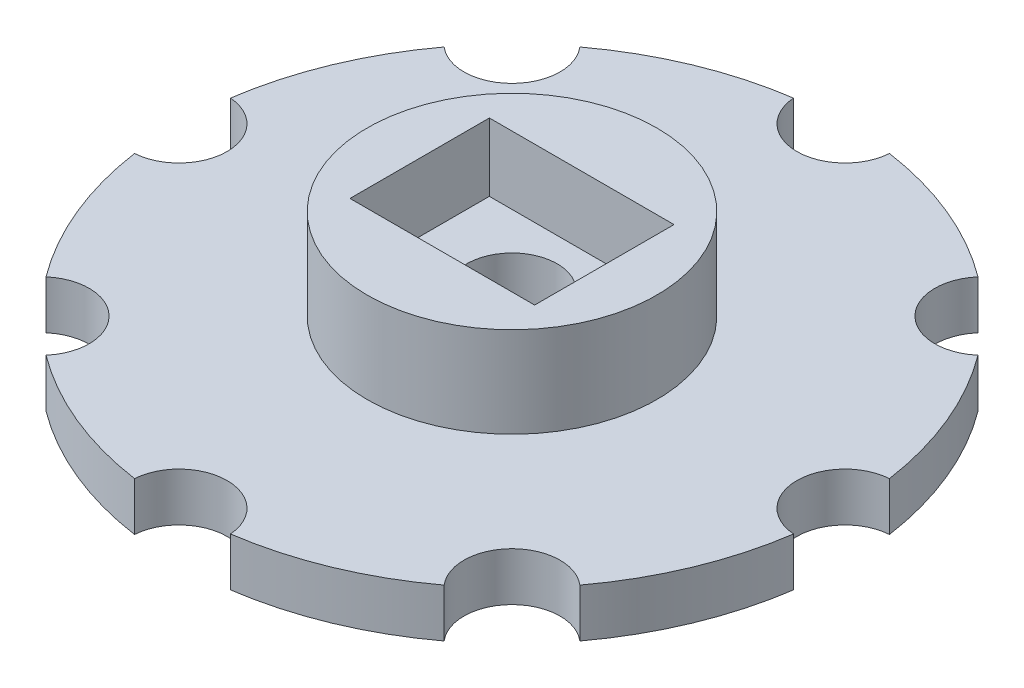
ISO-10303-21;
HEADER;
FILE_DESCRIPTION(('STEP AP214'),'2;1');
FILE_NAME('part.step','',(''),(''),'','','');
FILE_SCHEMA(('AUTOMOTIVE_DESIGN { 1 0 10303 214 1 1 1 1 }'));
ENDSEC;
DATA;
#1=APPLICATION_CONTEXT('core data for automotive mechanical design processes');
#2=APPLICATION_PROTOCOL_DEFINITION('international standard','automotive_design',2000,#1);
#3=PRODUCT_CONTEXT('',#1,'mechanical');
#4=PRODUCT('Part','Part','',(#3));
#5=PRODUCT_RELATED_PRODUCT_CATEGORY('part','',(#4));
#6=PRODUCT_DEFINITION_FORMATION('','',#4);
#7=PRODUCT_DEFINITION_CONTEXT('part definition',#1,'design');
#8=PRODUCT_DEFINITION('design','',#6,#7);
#9=PRODUCT_DEFINITION_SHAPE('','',#8);
#10=(LENGTH_UNIT() NAMED_UNIT(*) SI_UNIT(.MILLI.,.METRE.));
#11=(NAMED_UNIT(*) PLANE_ANGLE_UNIT() SI_UNIT($,.RADIAN.));
#12=(NAMED_UNIT(*) SI_UNIT($,.STERADIAN.) SOLID_ANGLE_UNIT());
#13=UNCERTAINTY_MEASURE_WITH_UNIT(LENGTH_MEASURE(1.E-05),#10,'distance_accuracy_value','');
#14=(GEOMETRIC_REPRESENTATION_CONTEXT(3) GLOBAL_UNCERTAINTY_ASSIGNED_CONTEXT((#13)) GLOBAL_UNIT_ASSIGNED_CONTEXT((#10,
#11,#12)) REPRESENTATION_CONTEXT('',''));
#15=CARTESIAN_POINT('',(0.,0.,0.));
#16=DIRECTION('',(0.,0.,1.));
#17=DIRECTION('',(1.,0.,0.));
#18=AXIS2_PLACEMENT_3D('',#15,#16,#17);
#19=CARTESIAN_POINT('',(0.,9.24152,0.));
#20=DIRECTION('',(0.,-1.,0.));
#21=DIRECTION('',(0.,0.,-1.));
#22=AXIS2_PLACEMENT_3D('',#19,#20,#21);
#23=CYLINDRICAL_SURFACE('',#22,3.175);
#24=CARTESIAN_POINT('',(0.,-0.508,0.));
#25=DIRECTION('',(0.,1.,0.));
#26=DIRECTION('',(0.,0.,1.));
#27=AXIS2_PLACEMENT_3D('',#24,#25,#26);
#28=CIRCLE('',#27,3.175);
#29=CARTESIAN_POINT('',(0.,-0.508,3.175));
#30=VERTEX_POINT('',#29);
#31=EDGE_CURVE('E539',#30,#30,#28,.F.);
#32=ORIENTED_EDGE('',*,*,#31,.T.);
#33=EDGE_LOOP('',(#32));
#34=FACE_BOUND('',#33,.T.);
#35=CARTESIAN_POINT('',(0.,4.47802,0.));
#36=DIRECTION('',(0.,1.,0.));
#37=DIRECTION('',(0.,0.,1.));
#38=AXIS2_PLACEMENT_3D('',#35,#36,#37);
#39=CIRCLE('',#38,3.175);
#40=CARTESIAN_POINT('',(0.,4.47802,3.175));
#41=VERTEX_POINT('',#40);
#42=EDGE_CURVE('E365',#41,#41,#39,.T.);
#43=ORIENTED_EDGE('',*,*,#42,.T.);
#44=EDGE_LOOP('',(#43));
#45=FACE_BOUND('',#44,.T.);
#46=ADVANCED_FACE('F361',(#34,#45),#23,.F.);
#47=CARTESIAN_POINT('',(8.25902930134583,-0.508,-8.25902930134575));
#48=DIRECTION('',(0.,1.,0.));
#49=DIRECTION('',(0.,0.,1.));
#50=AXIS2_PLACEMENT_3D('',#47,#48,#49);
#51=PLANE('',#50);
#52=CARTESIAN_POINT('',(0.,-0.508,0.));
#53=DIRECTION('',(0.,1.,0.));
#54=DIRECTION('',(0.,0.,1.));
#55=AXIS2_PLACEMENT_3D('',#52,#53,#54);
#56=CIRCLE('',#55,23.3600625);
#57=CARTESIAN_POINT('',(23.1164826601257,-0.508,-3.36463213858707));
#58=VERTEX_POINT('',#57);
#59=CARTESIAN_POINT('',(18.7249758475493,-0.508,-13.9666674447629));
#60=VERTEX_POINT('',#59);
#61=EDGE_CURVE('E548',#58,#60,#56,.T.);
#62=ORIENTED_EDGE('',*,*,#61,.F.);
#63=CARTESIAN_POINT('',(23.3600625,-0.508,0.));
#64=DIRECTION('',(0.,-1.,0.));
#65=DIRECTION('',(0.,0.,1.));
#66=AXIS2_PLACEMENT_3D('',#63,#64,#65);
#67=CIRCLE('',#66,3.3734375);
#68=CARTESIAN_POINT('',(23.1164826601257,-0.508,3.36463213858709));
#69=VERTEX_POINT('',#68);
#70=EDGE_CURVE('E593',#69,#58,#67,.T.);
#71=ORIENTED_EDGE('',*,*,#70,.F.);
#72=CARTESIAN_POINT('',(0.,-0.508,0.));
#73=DIRECTION('',(0.,1.,0.));
#74=DIRECTION('',(0.,0.,1.));
#75=AXIS2_PLACEMENT_3D('',#72,#73,#74);
#76=CIRCLE('',#75,23.3600625);
#77=CARTESIAN_POINT('',(18.7249758475493,-0.508,13.9666674447629));
#78=VERTEX_POINT('',#77);
#79=EDGE_CURVE('E590',#78,#69,#76,.T.);
#80=ORIENTED_EDGE('',*,*,#79,.F.);
#81=CARTESIAN_POINT('',(16.5180586026917,-0.508,16.5180586026915));
#82=DIRECTION('',(0.,-1.,0.));
#83=DIRECTION('',(0.,0.,1.));
#84=AXIS2_PLACEMENT_3D('',#81,#82,#83);
#85=CIRCLE('',#84,3.3734375);
#86=CARTESIAN_POINT('',(13.9666674447631,-0.508,18.7249758475492));
#87=VERTEX_POINT('',#86);
#88=EDGE_CURVE('E587',#87,#78,#85,.T.);
#89=ORIENTED_EDGE('',*,*,#88,.F.);
#90=CARTESIAN_POINT('',(0.,-0.508,0.));
#91=DIRECTION('',(0.,1.,0.));
#92=DIRECTION('',(0.,0.,1.));
#93=AXIS2_PLACEMENT_3D('',#90,#91,#92);
#94=CIRCLE('',#93,23.3600625);
#95=CARTESIAN_POINT('',(3.36463213858709,-0.508,23.1164826601257));
#96=VERTEX_POINT('',#95);
#97=EDGE_CURVE('E584',#96,#87,#94,.T.);
#98=ORIENTED_EDGE('',*,*,#97,.F.);
#99=CARTESIAN_POINT('',(0.,-0.508,23.3600625));
#100=DIRECTION('',(0.,-1.,0.));
#101=DIRECTION('',(0.,0.,1.));
#102=AXIS2_PLACEMENT_3D('',#99,#100,#101);
#103=CIRCLE('',#102,3.3734375);
#104=CARTESIAN_POINT('',(-3.36463213858708,-0.508,23.1164826601257));
#105=VERTEX_POINT('',#104);
#106=EDGE_CURVE('E581',#105,#96,#103,.T.);
#107=ORIENTED_EDGE('',*,*,#106,.F.);
#108=CARTESIAN_POINT('',(0.,-0.508,0.));
#109=DIRECTION('',(0.,1.,0.));
#110=DIRECTION('',(0.,0.,1.));
#111=AXIS2_PLACEMENT_3D('',#108,#109,#110);
#112=CIRCLE('',#111,23.3600625);
#113=CARTESIAN_POINT('',(-13.9666674447631,-0.508,18.7249758475492));
#114=VERTEX_POINT('',#113);
#115=EDGE_CURVE('E578',#114,#105,#112,.T.);
#116=ORIENTED_EDGE('',*,*,#115,.F.);
#117=CARTESIAN_POINT('',(-16.5180586026917,-0.508,16.5180586026915));
#118=DIRECTION('',(0.,-1.,0.));
#119=DIRECTION('',(0.,0.,1.));
#120=AXIS2_PLACEMENT_3D('',#117,#118,#119);
#121=CIRCLE('',#120,3.3734375);
#122=CARTESIAN_POINT('',(-18.7249758475493,-0.508,13.9666674447629));
#123=VERTEX_POINT('',#122);
#124=EDGE_CURVE('E575',#123,#114,#121,.T.);
#125=ORIENTED_EDGE('',*,*,#124,.F.);
#126=CARTESIAN_POINT('',(0.,-0.508,0.));
#127=DIRECTION('',(0.,1.,0.));
#128=DIRECTION('',(0.,0.,1.));
#129=AXIS2_PLACEMENT_3D('',#126,#127,#128);
#130=CIRCLE('',#129,23.3600625);
#131=CARTESIAN_POINT('',(-23.1164826601257,-0.508,3.36463213858709));
#132=VERTEX_POINT('',#131);
#133=EDGE_CURVE('E572',#132,#123,#130,.T.);
#134=ORIENTED_EDGE('',*,*,#133,.F.);
#135=CARTESIAN_POINT('',(-23.3600625,-0.508,0.));
#136=DIRECTION('',(0.,-1.,0.));
#137=DIRECTION('',(0.,0.,1.));
#138=AXIS2_PLACEMENT_3D('',#135,#136,#137);
#139=CIRCLE('',#138,3.3734375);
#140=CARTESIAN_POINT('',(-23.1164826601257,-0.508,-3.36463213858707));
#141=VERTEX_POINT('',#140);
#142=EDGE_CURVE('E569',#141,#132,#139,.T.);
#143=ORIENTED_EDGE('',*,*,#142,.F.);
#144=CARTESIAN_POINT('',(0.,-0.508,0.));
#145=DIRECTION('',(0.,1.,0.));
#146=DIRECTION('',(0.,0.,1.));
#147=AXIS2_PLACEMENT_3D('',#144,#145,#146);
#148=CIRCLE('',#147,23.3600625);
#149=CARTESIAN_POINT('',(-18.7249758475493,-0.508,-13.9666674447629));
#150=VERTEX_POINT('',#149);
#151=EDGE_CURVE('E566',#150,#141,#148,.T.);
#152=ORIENTED_EDGE('',*,*,#151,.F.);
#153=CARTESIAN_POINT('',(-16.5180586026917,-0.508,-16.5180586026915));
#154=DIRECTION('',(0.,-1.,0.));
#155=DIRECTION('',(0.,0.,1.));
#156=AXIS2_PLACEMENT_3D('',#153,#154,#155);
#157=CIRCLE('',#156,3.3734375);
#158=CARTESIAN_POINT('',(-13.9666674447631,-0.508,-18.7249758475492));
#159=VERTEX_POINT('',#158);
#160=EDGE_CURVE('E563',#159,#150,#157,.T.);
#161=ORIENTED_EDGE('',*,*,#160,.F.);
#162=CARTESIAN_POINT('',(0.,-0.508,0.));
#163=DIRECTION('',(0.,1.,0.));
#164=DIRECTION('',(0.,0.,1.));
#165=AXIS2_PLACEMENT_3D('',#162,#163,#164);
#166=CIRCLE('',#165,23.3600625);
#167=CARTESIAN_POINT('',(-3.36463213858707,-0.508,-23.1164826601257));
#168=VERTEX_POINT('',#167);
#169=EDGE_CURVE('E560',#168,#159,#166,.T.);
#170=ORIENTED_EDGE('',*,*,#169,.F.);
#171=CARTESIAN_POINT('',(0.,-0.508,-23.3600625));
#172=DIRECTION('',(0.,-1.,0.));
#173=DIRECTION('',(0.,0.,1.));
#174=AXIS2_PLACEMENT_3D('',#171,#172,#173);
#175=CIRCLE('',#174,3.3734375);
#176=CARTESIAN_POINT('',(3.36463213858708,-0.508,-23.1164826601257));
#177=VERTEX_POINT('',#176);
#178=EDGE_CURVE('E557',#177,#168,#175,.T.);
#179=ORIENTED_EDGE('',*,*,#178,.F.);
#180=CARTESIAN_POINT('',(0.,-0.508,0.));
#181=DIRECTION('',(0.,1.,0.));
#182=DIRECTION('',(0.,0.,1.));
#183=AXIS2_PLACEMENT_3D('',#180,#181,#182);
#184=CIRCLE('',#183,23.3600625);
#185=CARTESIAN_POINT('',(13.9666674447631,-0.508,-18.7249758475492));
#186=VERTEX_POINT('',#185);
#187=EDGE_CURVE('E554',#186,#177,#184,.T.);
#188=ORIENTED_EDGE('',*,*,#187,.F.);
#189=CARTESIAN_POINT('',(16.5180586026917,-0.508,-16.5180586026915));
#190=DIRECTION('',(0.,-1.,0.));
#191=DIRECTION('',(0.,0.,1.));
#192=AXIS2_PLACEMENT_3D('',#189,#190,#191);
#193=CIRCLE('',#192,3.3734375);
#194=EDGE_CURVE('E551',#60,#186,#193,.T.);
#195=ORIENTED_EDGE('',*,*,#194,.F.);
#196=EDGE_LOOP('',(#62,#71,#80,#89,#98,#107,#116,#125,#134,#143,#152,#161,#170,#179,#188,#195));
#197=FACE_BOUND('',#196,.T.);
#198=ORIENTED_EDGE('',*,*,#31,.F.);
#199=EDGE_LOOP('',(#198));
#200=FACE_BOUND('',#199,.T.);
#201=ADVANCED_FACE('F666',(#197,#200),#51,.F.);
#202=CARTESIAN_POINT('',(0.,9.24052,0.));
#203=DIRECTION('',(0.,1.,0.));
#204=DIRECTION('',(0.,0.,1.));
#205=AXIS2_PLACEMENT_3D('',#202,#203,#204);
#206=PLANE('',#205);
#207=DIRECTION('',(0.,0.,1.));
#208=VECTOR('',#207,1.);
#209=CARTESIAN_POINT('',(-6.477,9.24052,-4.8895));
#210=LINE('',#209,#208);
#211=CARTESIAN_POINT('',(-6.477,9.24052,-4.8895));
#212=VERTEX_POINT('',#211);
#213=CARTESIAN_POINT('',(-6.477,9.24052,4.8895));
#214=VERTEX_POINT('',#213);
#215=EDGE_CURVE('E377',#212,#214,#210,.T.);
#216=ORIENTED_EDGE('',*,*,#215,.F.);
#217=DIRECTION('',(-1.,0.,0.));
#218=VECTOR('',#217,1.);
#219=CARTESIAN_POINT('',(-6.477,9.24052,-4.8895));
#220=LINE('',#219,#218);
#221=CARTESIAN_POINT('',(6.477,9.24052,-4.8895));
#222=VERTEX_POINT('',#221);
#223=EDGE_CURVE('E521',#222,#212,#220,.T.);
#224=ORIENTED_EDGE('',*,*,#223,.F.);
#225=DIRECTION('',(0.,0.,-1.));
#226=VECTOR('',#225,1.);
#227=CARTESIAN_POINT('',(6.477,9.24052,-4.8895));
#228=LINE('',#227,#226);
#229=CARTESIAN_POINT('',(6.477,9.24052,4.8895));
#230=VERTEX_POINT('',#229);
#231=EDGE_CURVE('E503',#230,#222,#228,.T.);
#232=ORIENTED_EDGE('',*,*,#231,.F.);
#233=DIRECTION('',(1.,0.,0.));
#234=VECTOR('',#233,1.);
#235=CARTESIAN_POINT('',(-6.477,9.24052,4.8895));
#236=LINE('',#235,#234);
#237=EDGE_CURVE('E514',#214,#230,#236,.T.);
#238=ORIENTED_EDGE('',*,*,#237,.F.);
#239=EDGE_LOOP('',(#216,#224,#232,#238));
#240=FACE_BOUND('',#239,.T.);
#241=CARTESIAN_POINT('',(0.,9.24052,0.));
#242=DIRECTION('',(0.,1.,0.));
#243=DIRECTION('',(0.,0.,1.));
#244=AXIS2_PLACEMENT_3D('',#241,#242,#243);
#245=CIRCLE('',#244,10.16);
#246=CARTESIAN_POINT('',(0.,9.24052,10.16));
#247=VERTEX_POINT('',#246);
#248=EDGE_CURVE('E545',#247,#247,#245,.T.);
#249=ORIENTED_EDGE('',*,*,#248,.T.);
#250=EDGE_LOOP('',(#249));
#251=FACE_BOUND('',#250,.T.);
#252=ADVANCED_FACE('F518',(#240,#251),#206,.T.);
#253=CARTESIAN_POINT('',(8.25902930134583,2.89052,-8.25902930134575));
#254=DIRECTION('',(0.,1.,0.));
#255=DIRECTION('',(0.,0.,1.));
#256=AXIS2_PLACEMENT_3D('',#253,#254,#255);
#257=PLANE('',#256);
#258=CARTESIAN_POINT('',(0.,2.89052,0.));
#259=DIRECTION('',(0.,1.,0.));
#260=DIRECTION('',(0.,0.,1.));
#261=AXIS2_PLACEMENT_3D('',#258,#259,#260);
#262=CIRCLE('',#261,23.3600625);
#263=CARTESIAN_POINT('',(23.1164826601257,2.89052,-3.36463213858707));
#264=VERTEX_POINT('',#263);
#265=CARTESIAN_POINT('',(18.7249758475493,2.89052,-13.9666674447629));
#266=VERTEX_POINT('',#265);
#267=EDGE_CURVE('E596',#264,#266,#262,.T.);
#268=ORIENTED_EDGE('',*,*,#267,.T.);
#269=CARTESIAN_POINT('',(16.5180586026917,2.89052,-16.5180586026915));
#270=DIRECTION('',(0.,-1.,0.));
#271=DIRECTION('',(0.,0.,1.));
#272=AXIS2_PLACEMENT_3D('',#269,#270,#271);
#273=CIRCLE('',#272,3.3734375);
#274=CARTESIAN_POINT('',(13.9666674447631,2.89052,-18.7249758475492));
#275=VERTEX_POINT('',#274);
#276=EDGE_CURVE('E598',#266,#275,#273,.T.);
#277=ORIENTED_EDGE('',*,*,#276,.T.);
#278=CARTESIAN_POINT('',(0.,2.89052,0.));
#279=DIRECTION('',(0.,1.,0.));
#280=DIRECTION('',(0.,0.,1.));
#281=AXIS2_PLACEMENT_3D('',#278,#279,#280);
#282=CIRCLE('',#281,23.3600625);
#283=CARTESIAN_POINT('',(3.36463213858708,2.89052,-23.1164826601257));
#284=VERTEX_POINT('',#283);
#285=EDGE_CURVE('E600',#275,#284,#282,.T.);
#286=ORIENTED_EDGE('',*,*,#285,.T.);
#287=CARTESIAN_POINT('',(0.,2.89052,-23.3600625));
#288=DIRECTION('',(0.,-1.,0.));
#289=DIRECTION('',(0.,0.,1.));
#290=AXIS2_PLACEMENT_3D('',#287,#288,#289);
#291=CIRCLE('',#290,3.3734375);
#292=CARTESIAN_POINT('',(-3.36463213858707,2.89052,-23.1164826601257));
#293=VERTEX_POINT('',#292);
#294=EDGE_CURVE('E602',#284,#293,#291,.T.);
#295=ORIENTED_EDGE('',*,*,#294,.T.);
#296=CARTESIAN_POINT('',(0.,2.89052,0.));
#297=DIRECTION('',(0.,1.,0.));
#298=DIRECTION('',(0.,0.,1.));
#299=AXIS2_PLACEMENT_3D('',#296,#297,#298);
#300=CIRCLE('',#299,23.3600625);
#301=CARTESIAN_POINT('',(-13.9666674447631,2.89052,-18.7249758475492));
#302=VERTEX_POINT('',#301);
#303=EDGE_CURVE('E604',#293,#302,#300,.T.);
#304=ORIENTED_EDGE('',*,*,#303,.T.);
#305=CARTESIAN_POINT('',(-16.5180586026917,2.89052,-16.5180586026915));
#306=DIRECTION('',(0.,-1.,0.));
#307=DIRECTION('',(0.,0.,1.));
#308=AXIS2_PLACEMENT_3D('',#305,#306,#307);
#309=CIRCLE('',#308,3.3734375);
#310=CARTESIAN_POINT('',(-18.7249758475493,2.89052,-13.9666674447629));
#311=VERTEX_POINT('',#310);
#312=EDGE_CURVE('E606',#302,#311,#309,.T.);
#313=ORIENTED_EDGE('',*,*,#312,.T.);
#314=CARTESIAN_POINT('',(0.,2.89052,0.));
#315=DIRECTION('',(0.,1.,0.));
#316=DIRECTION('',(0.,0.,1.));
#317=AXIS2_PLACEMENT_3D('',#314,#315,#316);
#318=CIRCLE('',#317,23.3600625);
#319=CARTESIAN_POINT('',(-23.1164826601257,2.89052,-3.36463213858707));
#320=VERTEX_POINT('',#319);
#321=EDGE_CURVE('E608',#311,#320,#318,.T.);
#322=ORIENTED_EDGE('',*,*,#321,.T.);
#323=CARTESIAN_POINT('',(-23.3600625,2.89052,0.));
#324=DIRECTION('',(0.,-1.,0.));
#325=DIRECTION('',(0.,0.,1.));
#326=AXIS2_PLACEMENT_3D('',#323,#324,#325);
#327=CIRCLE('',#326,3.3734375);
#328=CARTESIAN_POINT('',(-23.1164826601257,2.89052,3.36463213858709));
#329=VERTEX_POINT('',#328);
#330=EDGE_CURVE('E610',#320,#329,#327,.T.);
#331=ORIENTED_EDGE('',*,*,#330,.T.);
#332=CARTESIAN_POINT('',(0.,2.89052,0.));
#333=DIRECTION('',(0.,1.,0.));
#334=DIRECTION('',(0.,0.,1.));
#335=AXIS2_PLACEMENT_3D('',#332,#333,#334);
#336=CIRCLE('',#335,23.3600625);
#337=CARTESIAN_POINT('',(-18.7249758475493,2.89052,13.9666674447629));
#338=VERTEX_POINT('',#337);
#339=EDGE_CURVE('E612',#329,#338,#336,.T.);
#340=ORIENTED_EDGE('',*,*,#339,.T.);
#341=CARTESIAN_POINT('',(-16.5180586026917,2.89052,16.5180586026915));
#342=DIRECTION('',(0.,-1.,0.));
#343=DIRECTION('',(0.,0.,1.));
#344=AXIS2_PLACEMENT_3D('',#341,#342,#343);
#345=CIRCLE('',#344,3.3734375);
#346=CARTESIAN_POINT('',(-13.9666674447631,2.89052,18.7249758475492));
#347=VERTEX_POINT('',#346);
#348=EDGE_CURVE('E614',#338,#347,#345,.T.);
#349=ORIENTED_EDGE('',*,*,#348,.T.);
#350=CARTESIAN_POINT('',(0.,2.89052,0.));
#351=DIRECTION('',(0.,1.,0.));
#352=DIRECTION('',(0.,0.,1.));
#353=AXIS2_PLACEMENT_3D('',#350,#351,#352);
#354=CIRCLE('',#353,23.3600625);
#355=CARTESIAN_POINT('',(-3.36463213858708,2.89052,23.1164826601257));
#356=VERTEX_POINT('',#355);
#357=EDGE_CURVE('E616',#347,#356,#354,.T.);
#358=ORIENTED_EDGE('',*,*,#357,.T.);
#359=CARTESIAN_POINT('',(0.,2.89052,23.3600625));
#360=DIRECTION('',(0.,-1.,0.));
#361=DIRECTION('',(0.,0.,1.));
#362=AXIS2_PLACEMENT_3D('',#359,#360,#361);
#363=CIRCLE('',#362,3.3734375);
#364=CARTESIAN_POINT('',(3.36463213858709,2.89052,23.1164826601257));
#365=VERTEX_POINT('',#364);
#366=EDGE_CURVE('E618',#356,#365,#363,.T.);
#367=ORIENTED_EDGE('',*,*,#366,.T.);
#368=CARTESIAN_POINT('',(0.,2.89052,0.));
#369=DIRECTION('',(0.,1.,0.));
#370=DIRECTION('',(0.,0.,1.));
#371=AXIS2_PLACEMENT_3D('',#368,#369,#370);
#372=CIRCLE('',#371,23.3600625);
#373=CARTESIAN_POINT('',(13.9666674447631,2.89052,18.7249758475492));
#374=VERTEX_POINT('',#373);
#375=EDGE_CURVE('E620',#365,#374,#372,.T.);
#376=ORIENTED_EDGE('',*,*,#375,.T.);
#377=CARTESIAN_POINT('',(16.5180586026917,2.89052,16.5180586026915));
#378=DIRECTION('',(0.,-1.,0.));
#379=DIRECTION('',(0.,0.,1.));
#380=AXIS2_PLACEMENT_3D('',#377,#378,#379);
#381=CIRCLE('',#380,3.3734375);
#382=CARTESIAN_POINT('',(18.7249758475493,2.89052,13.9666674447629));
#383=VERTEX_POINT('',#382);
#384=EDGE_CURVE('E622',#374,#383,#381,.T.);
#385=ORIENTED_EDGE('',*,*,#384,.T.);
#386=CARTESIAN_POINT('',(0.,2.89052,0.));
#387=DIRECTION('',(0.,1.,0.));
#388=DIRECTION('',(0.,0.,1.));
#389=AXIS2_PLACEMENT_3D('',#386,#387,#388);
#390=CIRCLE('',#389,23.3600625);
#391=CARTESIAN_POINT('',(23.1164826601257,2.89052,3.36463213858709));
#392=VERTEX_POINT('',#391);
#393=EDGE_CURVE('E624',#383,#392,#390,.T.);
#394=ORIENTED_EDGE('',*,*,#393,.T.);
#395=CARTESIAN_POINT('',(23.3600625,2.89052,0.));
#396=DIRECTION('',(0.,-1.,0.));
#397=DIRECTION('',(0.,0.,1.));
#398=AXIS2_PLACEMENT_3D('',#395,#396,#397);
#399=CIRCLE('',#398,3.3734375);
#400=EDGE_CURVE('E385',#392,#264,#399,.T.);
#401=ORIENTED_EDGE('',*,*,#400,.T.);
#402=EDGE_LOOP('',(#268,#277,#286,#295,#304,#313,#322,#331,#340,#349,#358,#367,#376,#385,#394,#401));
#403=FACE_BOUND('',#402,.T.);
#404=CARTESIAN_POINT('',(0.,2.89052,0.));
#405=DIRECTION('',(0.,1.,0.));
#406=DIRECTION('',(0.,0.,1.));
#407=AXIS2_PLACEMENT_3D('',#404,#405,#406);
#408=CIRCLE('',#407,10.16);
#409=CARTESIAN_POINT('',(0.,2.89052,10.16));
#410=VERTEX_POINT('',#409);
#411=EDGE_CURVE('E542',#410,#410,#408,.T.);
#412=ORIENTED_EDGE('',*,*,#411,.F.);
#413=EDGE_LOOP('',(#412));
#414=FACE_BOUND('',#413,.T.);
#415=ADVANCED_FACE('F734',(#403,#414),#257,.T.);
#416=CARTESIAN_POINT('',(0.,2.89052,0.));
#417=DIRECTION('',(0.,-1.,0.));
#418=DIRECTION('',(0.,0.,-1.));
#419=AXIS2_PLACEMENT_3D('',#416,#417,#418);
#420=CYLINDRICAL_SURFACE('',#419,23.3600625);
#421=DIRECTION('',(0.,-1.,0.));
#422=VECTOR('',#421,1.);
#423=CARTESIAN_POINT('',(23.1164826601257,2.89052,-3.36463213858707));
#424=LINE('',#423,#422);
#425=EDGE_CURVE('E627',#264,#58,#424,.T.);
#426=ORIENTED_EDGE('',*,*,#425,.T.);
#427=ORIENTED_EDGE('',*,*,#61,.T.);
#428=DIRECTION('',(0.,-1.,0.));
#429=VECTOR('',#428,1.);
#430=CARTESIAN_POINT('',(18.7249758475493,2.89052,-13.9666674447629));
#431=LINE('',#430,#429);
#432=EDGE_CURVE('E12',#266,#60,#431,.T.);
#433=ORIENTED_EDGE('',*,*,#432,.F.);
#434=ORIENTED_EDGE('',*,*,#267,.F.);
#435=EDGE_LOOP('',(#426,#427,#433,#434));
#436=FACE_BOUND('',#435,.T.);
#437=ADVANCED_FACE('F363',(#436),#420,.T.);
#438=CARTESIAN_POINT('',(16.5180586026917,2.89052,-16.5180586026915));
#439=DIRECTION('',(0.,-1.,0.));
#440=DIRECTION('',(0.,0.,-1.));
#441=AXIS2_PLACEMENT_3D('',#438,#439,#440);
#442=CYLINDRICAL_SURFACE('',#441,3.3734375);
#443=ORIENTED_EDGE('',*,*,#432,.T.);
#444=ORIENTED_EDGE('',*,*,#194,.T.);
#445=DIRECTION('',(0.,-1.,0.));
#446=VECTOR('',#445,1.);
#447=CARTESIAN_POINT('',(13.9666674447631,2.89052,-18.7249758475492));
#448=LINE('',#447,#446);
#449=EDGE_CURVE('E370',#275,#186,#448,.T.);
#450=ORIENTED_EDGE('',*,*,#449,.F.);
#451=ORIENTED_EDGE('',*,*,#276,.F.);
#452=EDGE_LOOP('',(#443,#444,#450,#451));
#453=FACE_BOUND('',#452,.T.);
#454=ADVANCED_FACE('F669',(#453),#442,.F.);
#455=CARTESIAN_POINT('',(0.,2.89052,0.));
#456=DIRECTION('',(0.,-1.,0.));
#457=DIRECTION('',(0.,0.,-1.));
#458=AXIS2_PLACEMENT_3D('',#455,#456,#457);
#459=CYLINDRICAL_SURFACE('',#458,23.3600625);
#460=ORIENTED_EDGE('',*,*,#449,.T.);
#461=ORIENTED_EDGE('',*,*,#187,.T.);
#462=DIRECTION('',(0.,-1.,0.));
#463=VECTOR('',#462,1.);
#464=CARTESIAN_POINT('',(3.36463213858708,2.89052,-23.1164826601257));
#465=LINE('',#464,#463);
#466=EDGE_CURVE('E653',#284,#177,#465,.T.);
#467=ORIENTED_EDGE('',*,*,#466,.F.);
#468=ORIENTED_EDGE('',*,*,#285,.F.);
#469=EDGE_LOOP('',(#460,#461,#467,#468));
#470=FACE_BOUND('',#469,.T.);
#471=ADVANCED_FACE('F659',(#470),#459,.T.);
#472=CARTESIAN_POINT('',(0.,2.89052,-23.3600625));
#473=DIRECTION('',(0.,-1.,0.));
#474=DIRECTION('',(0.,0.,-1.));
#475=AXIS2_PLACEMENT_3D('',#472,#473,#474);
#476=CYLINDRICAL_SURFACE('',#475,3.3734375);
#477=ORIENTED_EDGE('',*,*,#466,.T.);
#478=ORIENTED_EDGE('',*,*,#178,.T.);
#479=DIRECTION('',(0.,-1.,0.));
#480=VECTOR('',#479,1.);
#481=CARTESIAN_POINT('',(-3.36463213858707,2.89052,-23.1164826601257));
#482=LINE('',#481,#480);
#483=EDGE_CURVE('E651',#293,#168,#482,.T.);
#484=ORIENTED_EDGE('',*,*,#483,.F.);
#485=ORIENTED_EDGE('',*,*,#294,.F.);
#486=EDGE_LOOP('',(#477,#478,#484,#485));
#487=FACE_BOUND('',#486,.T.);
#488=ADVANCED_FACE('F732',(#487),#476,.F.);
#489=CARTESIAN_POINT('',(0.,2.89052,0.));
#490=DIRECTION('',(0.,-1.,0.));
#491=DIRECTION('',(0.,0.,-1.));
#492=AXIS2_PLACEMENT_3D('',#489,#490,#491);
#493=CYLINDRICAL_SURFACE('',#492,23.3600625);
#494=ORIENTED_EDGE('',*,*,#483,.T.);
#495=ORIENTED_EDGE('',*,*,#169,.T.);
#496=DIRECTION('',(0.,-1.,0.));
#497=VECTOR('',#496,1.);
#498=CARTESIAN_POINT('',(-13.9666674447631,2.89052,-18.7249758475492));
#499=LINE('',#498,#497);
#500=EDGE_CURVE('E649',#302,#159,#499,.T.);
#501=ORIENTED_EDGE('',*,*,#500,.F.);
#502=ORIENTED_EDGE('',*,*,#303,.F.);
#503=EDGE_LOOP('',(#494,#495,#501,#502));
#504=FACE_BOUND('',#503,.T.);
#505=ADVANCED_FACE('F729',(#504),#493,.T.);
#506=CARTESIAN_POINT('',(-16.5180586026917,2.89052,-16.5180586026915));
#507=DIRECTION('',(0.,-1.,0.));
#508=DIRECTION('',(0.,0.,-1.));
#509=AXIS2_PLACEMENT_3D('',#506,#507,#508);
#510=CYLINDRICAL_SURFACE('',#509,3.3734375);
#511=ORIENTED_EDGE('',*,*,#500,.T.);
#512=ORIENTED_EDGE('',*,*,#160,.T.);
#513=DIRECTION('',(0.,-1.,0.));
#514=VECTOR('',#513,1.);
#515=CARTESIAN_POINT('',(-18.7249758475493,2.89052,-13.9666674447629));
#516=LINE('',#515,#514);
#517=EDGE_CURVE('E647',#311,#150,#516,.T.);
#518=ORIENTED_EDGE('',*,*,#517,.F.);
#519=ORIENTED_EDGE('',*,*,#312,.F.);
#520=EDGE_LOOP('',(#511,#512,#518,#519));
#521=FACE_BOUND('',#520,.T.);
#522=ADVANCED_FACE('F724',(#521),#510,.F.);
#523=CARTESIAN_POINT('',(0.,2.89052,0.));
#524=DIRECTION('',(0.,-1.,0.));
#525=DIRECTION('',(0.,0.,-1.));
#526=AXIS2_PLACEMENT_3D('',#523,#524,#525);
#527=CYLINDRICAL_SURFACE('',#526,23.3600625);
#528=ORIENTED_EDGE('',*,*,#517,.T.);
#529=ORIENTED_EDGE('',*,*,#151,.T.);
#530=DIRECTION('',(0.,-1.,0.));
#531=VECTOR('',#530,1.);
#532=CARTESIAN_POINT('',(-23.1164826601257,2.89052,-3.36463213858707));
#533=LINE('',#532,#531);
#534=EDGE_CURVE('E645',#320,#141,#533,.T.);
#535=ORIENTED_EDGE('',*,*,#534,.F.);
#536=ORIENTED_EDGE('',*,*,#321,.F.);
#537=EDGE_LOOP('',(#528,#529,#535,#536));
#538=FACE_BOUND('',#537,.T.);
#539=ADVANCED_FACE('F720',(#538),#527,.T.);
#540=CARTESIAN_POINT('',(-23.3600625,2.89052,0.));
#541=DIRECTION('',(0.,-1.,0.));
#542=DIRECTION('',(0.,0.,-1.));
#543=AXIS2_PLACEMENT_3D('',#540,#541,#542);
#544=CYLINDRICAL_SURFACE('',#543,3.3734375);
#545=ORIENTED_EDGE('',*,*,#534,.T.);
#546=ORIENTED_EDGE('',*,*,#142,.T.);
#547=DIRECTION('',(0.,-1.,0.));
#548=VECTOR('',#547,1.);
#549=CARTESIAN_POINT('',(-23.1164826601257,2.89052,3.36463213858709));
#550=LINE('',#549,#548);
#551=EDGE_CURVE('E643',#329,#132,#550,.T.);
#552=ORIENTED_EDGE('',*,*,#551,.F.);
#553=ORIENTED_EDGE('',*,*,#330,.F.);
#554=EDGE_LOOP('',(#545,#546,#552,#553));
#555=FACE_BOUND('',#554,.T.);
#556=ADVANCED_FACE('F715',(#555),#544,.F.);
#557=CARTESIAN_POINT('',(0.,2.89052,0.));
#558=DIRECTION('',(0.,-1.,0.));
#559=DIRECTION('',(0.,0.,-1.));
#560=AXIS2_PLACEMENT_3D('',#557,#558,#559);
#561=CYLINDRICAL_SURFACE('',#560,23.3600625);
#562=ORIENTED_EDGE('',*,*,#551,.T.);
#563=ORIENTED_EDGE('',*,*,#133,.T.);
#564=DIRECTION('',(0.,-1.,0.));
#565=VECTOR('',#564,1.);
#566=CARTESIAN_POINT('',(-18.7249758475493,2.89052,13.9666674447629));
#567=LINE('',#566,#565);
#568=EDGE_CURVE('E641',#338,#123,#567,.T.);
#569=ORIENTED_EDGE('',*,*,#568,.F.);
#570=ORIENTED_EDGE('',*,*,#339,.F.);
#571=EDGE_LOOP('',(#562,#563,#569,#570));
#572=FACE_BOUND('',#571,.T.);
#573=ADVANCED_FACE('F710',(#572),#561,.T.);
#574=CARTESIAN_POINT('',(-16.5180586026917,2.89052,16.5180586026915));
#575=DIRECTION('',(0.,-1.,0.));
#576=DIRECTION('',(0.,0.,-1.));
#577=AXIS2_PLACEMENT_3D('',#574,#575,#576);
#578=CYLINDRICAL_SURFACE('',#577,3.3734375);
#579=ORIENTED_EDGE('',*,*,#568,.T.);
#580=ORIENTED_EDGE('',*,*,#124,.T.);
#581=DIRECTION('',(0.,-1.,0.));
#582=VECTOR('',#581,1.);
#583=CARTESIAN_POINT('',(-13.9666674447631,2.89052,18.7249758475492));
#584=LINE('',#583,#582);
#585=EDGE_CURVE('E639',#347,#114,#584,.T.);
#586=ORIENTED_EDGE('',*,*,#585,.F.);
#587=ORIENTED_EDGE('',*,*,#348,.F.);
#588=EDGE_LOOP('',(#579,#580,#586,#587));
#589=FACE_BOUND('',#588,.T.);
#590=ADVANCED_FACE('F705',(#589),#578,.F.);
#591=CARTESIAN_POINT('',(0.,2.89052,0.));
#592=DIRECTION('',(0.,-1.,0.));
#593=DIRECTION('',(0.,0.,-1.));
#594=AXIS2_PLACEMENT_3D('',#591,#592,#593);
#595=CYLINDRICAL_SURFACE('',#594,23.3600625);
#596=ORIENTED_EDGE('',*,*,#585,.T.);
#597=ORIENTED_EDGE('',*,*,#115,.T.);
#598=DIRECTION('',(0.,-1.,0.));
#599=VECTOR('',#598,1.);
#600=CARTESIAN_POINT('',(-3.36463213858708,2.89052,23.1164826601257));
#601=LINE('',#600,#599);
#602=EDGE_CURVE('E637',#356,#105,#601,.T.);
#603=ORIENTED_EDGE('',*,*,#602,.F.);
#604=ORIENTED_EDGE('',*,*,#357,.F.);
#605=EDGE_LOOP('',(#596,#597,#603,#604));
#606=FACE_BOUND('',#605,.T.);
#607=ADVANCED_FACE('F700',(#606),#595,.T.);
#608=CARTESIAN_POINT('',(0.,2.89052,23.3600625));
#609=DIRECTION('',(0.,-1.,0.));
#610=DIRECTION('',(0.,0.,-1.));
#611=AXIS2_PLACEMENT_3D('',#608,#609,#610);
#612=CYLINDRICAL_SURFACE('',#611,3.3734375);
#613=ORIENTED_EDGE('',*,*,#602,.T.);
#614=ORIENTED_EDGE('',*,*,#106,.T.);
#615=DIRECTION('',(0.,-1.,0.));
#616=VECTOR('',#615,1.);
#617=CARTESIAN_POINT('',(3.36463213858709,2.89052,23.1164826601257));
#618=LINE('',#617,#616);
#619=EDGE_CURVE('E635',#365,#96,#618,.T.);
#620=ORIENTED_EDGE('',*,*,#619,.F.);
#621=ORIENTED_EDGE('',*,*,#366,.F.);
#622=EDGE_LOOP('',(#613,#614,#620,#621));
#623=FACE_BOUND('',#622,.T.);
#624=ADVANCED_FACE('F695',(#623),#612,.F.);
#625=CARTESIAN_POINT('',(0.,2.89052,0.));
#626=DIRECTION('',(0.,-1.,0.));
#627=DIRECTION('',(0.,0.,-1.));
#628=AXIS2_PLACEMENT_3D('',#625,#626,#627);
#629=CYLINDRICAL_SURFACE('',#628,23.3600625);
#630=ORIENTED_EDGE('',*,*,#619,.T.);
#631=ORIENTED_EDGE('',*,*,#97,.T.);
#632=DIRECTION('',(0.,-1.,0.));
#633=VECTOR('',#632,1.);
#634=CARTESIAN_POINT('',(13.9666674447631,2.89052,18.7249758475492));
#635=LINE('',#634,#633);
#636=EDGE_CURVE('E633',#374,#87,#635,.T.);
#637=ORIENTED_EDGE('',*,*,#636,.F.);
#638=ORIENTED_EDGE('',*,*,#375,.F.);
#639=EDGE_LOOP('',(#630,#631,#637,#638));
#640=FACE_BOUND('',#639,.T.);
#641=ADVANCED_FACE('F690',(#640),#629,.T.);
#642=CARTESIAN_POINT('',(16.5180586026917,2.89052,16.5180586026915));
#643=DIRECTION('',(0.,-1.,0.));
#644=DIRECTION('',(0.,0.,-1.));
#645=AXIS2_PLACEMENT_3D('',#642,#643,#644);
#646=CYLINDRICAL_SURFACE('',#645,3.3734375);
#647=ORIENTED_EDGE('',*,*,#636,.T.);
#648=ORIENTED_EDGE('',*,*,#88,.T.);
#649=DIRECTION('',(0.,-1.,0.));
#650=VECTOR('',#649,1.);
#651=CARTESIAN_POINT('',(18.7249758475493,2.89052,13.9666674447629));
#652=LINE('',#651,#650);
#653=EDGE_CURVE('E631',#383,#78,#652,.T.);
#654=ORIENTED_EDGE('',*,*,#653,.F.);
#655=ORIENTED_EDGE('',*,*,#384,.F.);
#656=EDGE_LOOP('',(#647,#648,#654,#655));
#657=FACE_BOUND('',#656,.T.);
#658=ADVANCED_FACE('F685',(#657),#646,.F.);
#659=CARTESIAN_POINT('',(0.,2.89052,0.));
#660=DIRECTION('',(0.,-1.,0.));
#661=DIRECTION('',(0.,0.,-1.));
#662=AXIS2_PLACEMENT_3D('',#659,#660,#661);
#663=CYLINDRICAL_SURFACE('',#662,23.3600625);
#664=ORIENTED_EDGE('',*,*,#653,.T.);
#665=ORIENTED_EDGE('',*,*,#79,.T.);
#666=DIRECTION('',(0.,-1.,0.));
#667=VECTOR('',#666,1.);
#668=CARTESIAN_POINT('',(23.1164826601257,2.89052,3.36463213858709));
#669=LINE('',#668,#667);
#670=EDGE_CURVE('E629',#392,#69,#669,.T.);
#671=ORIENTED_EDGE('',*,*,#670,.F.);
#672=ORIENTED_EDGE('',*,*,#393,.F.);
#673=EDGE_LOOP('',(#664,#665,#671,#672));
#674=FACE_BOUND('',#673,.T.);
#675=ADVANCED_FACE('F680',(#674),#663,.T.);
#676=CARTESIAN_POINT('',(23.3600625,2.89052,0.));
#677=DIRECTION('',(0.,-1.,0.));
#678=DIRECTION('',(0.,0.,-1.));
#679=AXIS2_PLACEMENT_3D('',#676,#677,#678);
#680=CYLINDRICAL_SURFACE('',#679,3.3734375);
#681=ORIENTED_EDGE('',*,*,#670,.T.);
#682=ORIENTED_EDGE('',*,*,#70,.T.);
#683=ORIENTED_EDGE('',*,*,#425,.F.);
#684=ORIENTED_EDGE('',*,*,#400,.F.);
#685=EDGE_LOOP('',(#681,#682,#683,#684));
#686=FACE_BOUND('',#685,.T.);
#687=ADVANCED_FACE('F676',(#686),#680,.F.);
#688=CARTESIAN_POINT('',(0.,9.24052,0.));
#689=DIRECTION('',(0.,-1.,0.));
#690=DIRECTION('',(0.,0.,-1.));
#691=AXIS2_PLACEMENT_3D('',#688,#689,#690);
#692=CYLINDRICAL_SURFACE('',#691,10.16);
#693=ORIENTED_EDGE('',*,*,#248,.F.);
#694=EDGE_LOOP('',(#693));
#695=FACE_BOUND('',#694,.T.);
#696=ORIENTED_EDGE('',*,*,#411,.T.);
#697=EDGE_LOOP('',(#696));
#698=FACE_BOUND('',#697,.T.);
#699=ADVANCED_FACE('F740',(#695,#698),#692,.T.);
#700=CARTESIAN_POINT('',(-6.477,4.47802,-4.8895));
#701=DIRECTION('',(-1.,0.,0.));
#702=DIRECTION('',(0.,0.,1.));
#703=AXIS2_PLACEMENT_3D('',#700,#701,#702);
#704=PLANE('',#703);
#705=ORIENTED_EDGE('',*,*,#215,.T.);
#706=DIRECTION('',(0.,1.,0.));
#707=VECTOR('',#706,1.);
#708=CARTESIAN_POINT('',(-6.477,4.47802,4.8895));
#709=LINE('',#708,#707);
#710=CARTESIAN_POINT('',(-6.477,4.47802,4.8895));
#711=VERTEX_POINT('',#710);
#712=EDGE_CURVE('E511',#711,#214,#709,.T.);
#713=ORIENTED_EDGE('',*,*,#712,.F.);
#714=DIRECTION('',(0.,0.,1.));
#715=VECTOR('',#714,1.);
#716=CARTESIAN_POINT('',(-6.477,4.47802,-4.8895));
#717=LINE('',#716,#715);
#718=CARTESIAN_POINT('',(-6.477,4.47802,-4.8895));
#719=VERTEX_POINT('',#718);
#720=EDGE_CURVE('E523',#719,#711,#717,.T.);
#721=ORIENTED_EDGE('',*,*,#720,.F.);
#722=DIRECTION('',(0.,1.,0.));
#723=VECTOR('',#722,1.);
#724=CARTESIAN_POINT('',(-6.477,4.47802,-4.8895));
#725=LINE('',#724,#723);
#726=EDGE_CURVE('E535',#719,#212,#725,.T.);
#727=ORIENTED_EDGE('',*,*,#726,.T.);
#728=EDGE_LOOP('',(#705,#713,#721,#727));
#729=FACE_BOUND('',#728,.T.);
#730=ADVANCED_FACE('F742',(#729),#704,.F.);
#731=CARTESIAN_POINT('',(-6.477,4.47802,-4.8895));
#732=DIRECTION('',(0.,0.,-1.));
#733=DIRECTION('',(-1.,0.,0.));
#734=AXIS2_PLACEMENT_3D('',#731,#732,#733);
#735=PLANE('',#734);
#736=ORIENTED_EDGE('',*,*,#223,.T.);
#737=ORIENTED_EDGE('',*,*,#726,.F.);
#738=DIRECTION('',(-1.,0.,0.));
#739=VECTOR('',#738,1.);
#740=CARTESIAN_POINT('',(-6.477,4.47802,-4.8895));
#741=LINE('',#740,#739);
#742=CARTESIAN_POINT('',(6.477,4.47802,-4.8895));
#743=VERTEX_POINT('',#742);
#744=EDGE_CURVE('E532',#743,#719,#741,.T.);
#745=ORIENTED_EDGE('',*,*,#744,.F.);
#746=DIRECTION('',(0.,1.,0.));
#747=VECTOR('',#746,1.);
#748=CARTESIAN_POINT('',(6.477,4.47802,-4.8895));
#749=LINE('',#748,#747);
#750=EDGE_CURVE('E510',#743,#222,#749,.T.);
#751=ORIENTED_EDGE('',*,*,#750,.T.);
#752=EDGE_LOOP('',(#736,#737,#745,#751));
#753=FACE_BOUND('',#752,.T.);
#754=ADVANCED_FACE('F749',(#753),#735,.F.);
#755=CARTESIAN_POINT('',(6.477,4.47802,-4.8895));
#756=DIRECTION('',(1.,0.,0.));
#757=DIRECTION('',(0.,0.,-1.));
#758=AXIS2_PLACEMENT_3D('',#755,#756,#757);
#759=PLANE('',#758);
#760=ORIENTED_EDGE('',*,*,#231,.T.);
#761=ORIENTED_EDGE('',*,*,#750,.F.);
#762=DIRECTION('',(0.,0.,-1.));
#763=VECTOR('',#762,1.);
#764=CARTESIAN_POINT('',(6.477,4.47802,-4.8895));
#765=LINE('',#764,#763);
#766=CARTESIAN_POINT('',(6.477,4.47802,4.8895));
#767=VERTEX_POINT('',#766);
#768=EDGE_CURVE('E506',#767,#743,#765,.T.);
#769=ORIENTED_EDGE('',*,*,#768,.F.);
#770=DIRECTION('',(0.,1.,0.));
#771=VECTOR('',#770,1.);
#772=CARTESIAN_POINT('',(6.477,4.47802,4.8895));
#773=LINE('',#772,#771);
#774=EDGE_CURVE('E499',#767,#230,#773,.T.);
#775=ORIENTED_EDGE('',*,*,#774,.T.);
#776=EDGE_LOOP('',(#760,#761,#769,#775));
#777=FACE_BOUND('',#776,.T.);
#778=ADVANCED_FACE('F501',(#777),#759,.F.);
#779=CARTESIAN_POINT('',(-6.477,4.47802,4.8895));
#780=DIRECTION('',(0.,0.,1.));
#781=DIRECTION('',(1.,0.,0.));
#782=AXIS2_PLACEMENT_3D('',#779,#780,#781);
#783=PLANE('',#782);
#784=ORIENTED_EDGE('',*,*,#237,.T.);
#785=ORIENTED_EDGE('',*,*,#774,.F.);
#786=DIRECTION('',(1.,0.,0.));
#787=VECTOR('',#786,1.);
#788=CARTESIAN_POINT('',(-6.477,4.47802,4.8895));
#789=LINE('',#788,#787);
#790=EDGE_CURVE('E529',#711,#767,#789,.T.);
#791=ORIENTED_EDGE('',*,*,#790,.F.);
#792=ORIENTED_EDGE('',*,*,#712,.T.);
#793=EDGE_LOOP('',(#784,#785,#791,#792));
#794=FACE_BOUND('',#793,.T.);
#795=ADVANCED_FACE('F515',(#794),#783,.F.);
#796=CARTESIAN_POINT('',(-6.477,4.47802,4.8895));
#797=DIRECTION('',(0.,1.,0.));
#798=DIRECTION('',(0.,0.,1.));
#799=AXIS2_PLACEMENT_3D('',#796,#797,#798);
#800=PLANE('',#799);
#801=ORIENTED_EDGE('',*,*,#42,.F.);
#802=EDGE_LOOP('',(#801));
#803=FACE_BOUND('',#802,.T.);
#804=ORIENTED_EDGE('',*,*,#720,.T.);
#805=ORIENTED_EDGE('',*,*,#790,.T.);
#806=ORIENTED_EDGE('',*,*,#768,.T.);
#807=ORIENTED_EDGE('',*,*,#744,.T.);
#808=EDGE_LOOP('',(#804,#805,#806,#807));
#809=FACE_BOUND('',#808,.T.);
#810=ADVANCED_FACE('F790',(#803,#809),#800,.T.);
#811=CLOSED_SHELL('',(#46,#201,#252,#415,#437,#454,#471,#488,#505,#522,#539,#556,#573,#590,#607,
#624,#641,#658,#675,#687,#699,#730,#754,#778,#795,#810));
#812=MANIFOLD_SOLID_BREP('B2',#811);
#813=ADVANCED_BREP_SHAPE_REPRESENTATION('',(#18,#812),#14);
#814=SHAPE_DEFINITION_REPRESENTATION(#9,#813);
ENDSEC;
END-ISO-10303-21;
